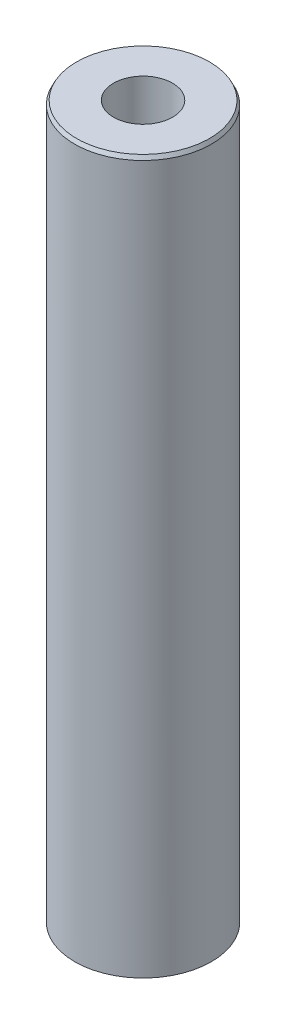
ISO-10303-21;
HEADER;
FILE_DESCRIPTION(('STEP AP214'),'2;1');
FILE_NAME('part.step','',(''),(''),'','','');
FILE_SCHEMA(('AUTOMOTIVE_DESIGN { 1 0 10303 214 1 1 1 1 }'));
ENDSEC;
DATA;
#1=APPLICATION_CONTEXT('core data for automotive mechanical design processes');
#2=APPLICATION_PROTOCOL_DEFINITION('international standard','automotive_design',2000,#1);
#3=PRODUCT_CONTEXT('',#1,'mechanical');
#4=PRODUCT('Part','Part','',(#3));
#5=PRODUCT_RELATED_PRODUCT_CATEGORY('part','',(#4));
#6=PRODUCT_DEFINITION_FORMATION('','',#4);
#7=PRODUCT_DEFINITION_CONTEXT('part definition',#1,'design');
#8=PRODUCT_DEFINITION('design','',#6,#7);
#9=PRODUCT_DEFINITION_SHAPE('','',#8);
#10=(LENGTH_UNIT() NAMED_UNIT(*) SI_UNIT(.MILLI.,.METRE.));
#11=(NAMED_UNIT(*) PLANE_ANGLE_UNIT() SI_UNIT($,.RADIAN.));
#12=(NAMED_UNIT(*) SI_UNIT($,.STERADIAN.) SOLID_ANGLE_UNIT());
#13=UNCERTAINTY_MEASURE_WITH_UNIT(LENGTH_MEASURE(1.E-05),#10,'distance_accuracy_value','');
#14=(GEOMETRIC_REPRESENTATION_CONTEXT(3) GLOBAL_UNCERTAINTY_ASSIGNED_CONTEXT((#13)) GLOBAL_UNIT_ASSIGNED_CONTEXT((#10,
#11,#12)) REPRESENTATION_CONTEXT('',''));
#15=CARTESIAN_POINT('',(0.,0.,0.));
#16=DIRECTION('',(0.,0.,1.));
#17=DIRECTION('',(1.,0.,0.));
#18=AXIS2_PLACEMENT_3D('',#15,#16,#17);
#19=CARTESIAN_POINT('',(0.,600.,0.));
#20=DIRECTION('',(0.,-1.,0.));
#21=DIRECTION('',(0.,0.,-1.));
#22=AXIS2_PLACEMENT_3D('',#19,#20,#21);
#23=CYLINDRICAL_SURFACE('',#22,57.5);
#24=CARTESIAN_POINT('',(0.,596.72802841033,0.));
#25=DIRECTION('',(0.,1.,0.));
#26=DIRECTION('',(0.,0.,1.));
#27=AXIS2_PLACEMENT_3D('',#24,#25,#26);
#28=CIRCLE('',#27,57.5);
#29=CARTESIAN_POINT('',(0.,596.72802841033,-57.5));
#30=VERTEX_POINT('',#29);
#31=EDGE_CURVE('E50',#30,#30,#28,.F.);
#32=ORIENTED_EDGE('',*,*,#31,.T.);
#33=EDGE_LOOP('',(#32));
#34=FACE_BOUND('',#33,.T.);
#35=CARTESIAN_POINT('',(0.,1.65994558215066,0.));
#36=DIRECTION('',(0.,1.,0.));
#37=DIRECTION('',(0.,0.,1.));
#38=AXIS2_PLACEMENT_3D('',#35,#36,#37);
#39=CIRCLE('',#38,57.5);
#40=CARTESIAN_POINT('',(0.,1.65994558215066,57.5));
#41=VERTEX_POINT('',#40);
#42=EDGE_CURVE('E51',#41,#41,#39,.T.);
#43=ORIENTED_EDGE('',*,*,#42,.T.);
#44=EDGE_LOOP('',(#43));
#45=FACE_BOUND('',#44,.T.);
#46=ADVANCED_FACE('F39',(#34,#45),#23,.T.);
#47=CARTESIAN_POINT('',(0.,600.,0.));
#48=DIRECTION('',(0.,1.,0.));
#49=DIRECTION('',(0.,0.,1.));
#50=AXIS2_PLACEMENT_3D('',#47,#48,#49);
#51=PLANE('',#50);
#52=CARTESIAN_POINT('',(0.,600.,0.));
#53=DIRECTION('',(0.,1.,0.));
#54=DIRECTION('',(0.,0.,1.));
#55=AXIS2_PLACEMENT_3D('',#52,#53,#54);
#56=CIRCLE('',#55,55.8400544178492);
#57=CARTESIAN_POINT('',(0.,600.,-55.8400544178493));
#58=VERTEX_POINT('',#57);
#59=EDGE_CURVE('E54',#58,#58,#56,.T.);
#60=ORIENTED_EDGE('',*,*,#59,.T.);
#61=EDGE_LOOP('',(#60));
#62=FACE_BOUND('',#61,.T.);
#63=CARTESIAN_POINT('',(0.,600.,0.));
#64=DIRECTION('',(0.,1.,0.));
#65=DIRECTION('',(0.,0.,1.));
#66=AXIS2_PLACEMENT_3D('',#63,#64,#65);
#67=CIRCLE('',#66,24.8235276278008);
#68=CARTESIAN_POINT('',(0.,600.,24.8235276278008));
#69=VERTEX_POINT('',#68);
#70=EDGE_CURVE('E58',#69,#69,#67,.T.);
#71=ORIENTED_EDGE('',*,*,#70,.F.);
#72=EDGE_LOOP('',(#71));
#73=FACE_BOUND('',#72,.T.);
#74=ADVANCED_FACE('F69',(#62,#73),#51,.T.);
#75=CARTESIAN_POINT('',(0.,0.,0.));
#76=DIRECTION('',(0.,1.,0.));
#77=DIRECTION('',(0.,0.,1.));
#78=AXIS2_PLACEMENT_3D('',#75,#76,#77);
#79=PLANE('',#78);
#80=CARTESIAN_POINT('',(0.,0.,0.));
#81=DIRECTION('',(0.,1.,0.));
#82=DIRECTION('',(0.,0.,1.));
#83=AXIS2_PLACEMENT_3D('',#80,#81,#82);
#84=CIRCLE('',#83,54.2280284103304);
#85=CARTESIAN_POINT('',(0.,0.,54.2280284103304));
#86=VERTEX_POINT('',#85);
#87=EDGE_CURVE('E10',#86,#86,#84,.F.);
#88=ORIENTED_EDGE('',*,*,#87,.T.);
#89=EDGE_LOOP('',(#88));
#90=FACE_BOUND('',#89,.T.);
#91=CARTESIAN_POINT('',(0.,0.,0.));
#92=DIRECTION('',(0.,1.,0.));
#93=DIRECTION('',(0.,0.,1.));
#94=AXIS2_PLACEMENT_3D('',#91,#92,#93);
#95=CIRCLE('',#94,24.8235276278008);
#96=CARTESIAN_POINT('',(0.,0.,24.8235276278008));
#97=VERTEX_POINT('',#96);
#98=EDGE_CURVE('E63',#97,#97,#95,.T.);
#99=ORIENTED_EDGE('',*,*,#98,.T.);
#100=EDGE_LOOP('',(#99));
#101=FACE_BOUND('',#100,.T.);
#102=ADVANCED_FACE('F75',(#90,#101),#79,.F.);
#103=CARTESIAN_POINT('',(0.,600.,0.));
#104=DIRECTION('',(0.,-1.,0.));
#105=DIRECTION('',(0.,0.,-1.));
#106=AXIS2_PLACEMENT_3D('',#103,#104,#105);
#107=CYLINDRICAL_SURFACE('',#106,24.8235276278008);
#108=ORIENTED_EDGE('',*,*,#70,.T.);
#109=EDGE_LOOP('',(#108));
#110=FACE_BOUND('',#109,.T.);
#111=ORIENTED_EDGE('',*,*,#98,.F.);
#112=EDGE_LOOP('',(#111));
#113=FACE_BOUND('',#112,.T.);
#114=ADVANCED_FACE('F70',(#110,#113),#107,.F.);
#115=CARTESIAN_POINT('',(0.,600.,0.));
#116=DIRECTION('',(0.,-1.,0.));
#117=DIRECTION('',(0.,0.,-1.));
#118=AXIS2_PLACEMENT_3D('',#115,#116,#117);
#119=CONICAL_SURFACE('',#118,55.8400544178492,0.469488623068551);
#120=CARTESIAN_POINT('',(0.,596.72802841033,-57.5));
#121=CARTESIAN_POINT('',(0.,596.762111447723,-57.482708900186));
#122=CARTESIAN_POINT('',(0.,596.796194485115,-57.4654178003719));
#123=CARTESIAN_POINT('',(0.,596.8643605599,-57.4308356007438));
#124=CARTESIAN_POINT('',(0.,596.898443597292,-57.4135445009297));
#125=CARTESIAN_POINT('',(0.,596.966609672077,-57.3789623013015));
#126=CARTESIAN_POINT('',(0.,597.000692709469,-57.3616712014875));
#127=CARTESIAN_POINT('',(0.,597.068858784254,-57.3270890018593));
#128=CARTESIAN_POINT('',(0.,597.102941821646,-57.3097979020452));
#129=CARTESIAN_POINT('',(0.,597.171107896431,-57.2752157024171));
#130=CARTESIAN_POINT('',(0.,597.205190933824,-57.257924602603));
#131=CARTESIAN_POINT('',(0.,597.273357008609,-57.2233424029749));
#132=CARTESIAN_POINT('',(0.,597.307440046001,-57.2060513031608));
#133=CARTESIAN_POINT('',(0.,597.375606120786,-57.1714691035327));
#134=CARTESIAN_POINT('',(0.,597.409689158178,-57.1541780037186));
#135=CARTESIAN_POINT('',(0.,597.477855232963,-57.1195958040905));
#136=CARTESIAN_POINT('',(0.,597.511938270355,-57.1023047042764));
#137=CARTESIAN_POINT('',(0.,597.58010434514,-57.0677225046483));
#138=CARTESIAN_POINT('',(0.,597.614187382532,-57.0504314048342));
#139=CARTESIAN_POINT('',(0.,597.682353457317,-57.015849205206));
#140=CARTESIAN_POINT('',(0.,597.71643649471,-56.998558105392));
#141=CARTESIAN_POINT('',(0.,597.784602569494,-56.9639759057639));
#142=CARTESIAN_POINT('',(0.,597.818685606887,-56.9466848059498));
#143=CARTESIAN_POINT('',(0.,597.886851681672,-56.9121026063216));
#144=CARTESIAN_POINT('',(0.,597.920934719064,-56.8948115065076));
#145=CARTESIAN_POINT('',(0.,597.989100793849,-56.8602293068794));
#146=CARTESIAN_POINT('',(0.,598.023183831241,-56.8429382070653));
#147=CARTESIAN_POINT('',(0.,598.091349906026,-56.8083560074372));
#148=CARTESIAN_POINT('',(0.,598.125432943418,-56.7910649076231));
#149=CARTESIAN_POINT('',(0.,598.193599018203,-56.756482707995));
#150=CARTESIAN_POINT('',(0.,598.227682055596,-56.7391916081809));
#151=CARTESIAN_POINT('',(0.,598.29584813038,-56.7046094085528));
#152=CARTESIAN_POINT('',(0.,598.329931167773,-56.6873183087387));
#153=CARTESIAN_POINT('',(0.,598.398097242557,-56.6527361091106));
#154=CARTESIAN_POINT('',(0.,598.43218027995,-56.6354450092965));
#155=CARTESIAN_POINT('',(0.,598.500346354735,-56.6008628096684));
#156=CARTESIAN_POINT('',(0.,598.534429392127,-56.5835717098543));
#157=CARTESIAN_POINT('',(0.,598.602595466912,-56.5489895102261));
#158=CARTESIAN_POINT('',(0.,598.636678504304,-56.5316984104121));
#159=CARTESIAN_POINT('',(0.,598.704844579089,-56.4971162107839));
#160=CARTESIAN_POINT('',(0.,598.738927616481,-56.4798251109699));
#161=CARTESIAN_POINT('',(0.,598.807093691266,-56.4452429113417));
#162=CARTESIAN_POINT('',(0.,598.841176728659,-56.4279518115277));
#163=CARTESIAN_POINT('',(0.,598.909342803443,-56.3933696118995));
#164=CARTESIAN_POINT('',(0.,598.943425840836,-56.3760785120854));
#165=CARTESIAN_POINT('',(0.,599.01159191562,-56.3414963124573));
#166=CARTESIAN_POINT('',(0.,599.045674953013,-56.3242052126432));
#167=CARTESIAN_POINT('',(0.,599.113841027798,-56.2896230130151));
#168=CARTESIAN_POINT('',(0.,599.14792406519,-56.272331913201));
#169=CARTESIAN_POINT('',(0.,599.216090139975,-56.2377497135729));
#170=CARTESIAN_POINT('',(0.,599.250173177367,-56.2204586137588));
#171=CARTESIAN_POINT('',(0.,599.318339252152,-56.1858764141307));
#172=CARTESIAN_POINT('',(0.,599.352422289544,-56.1685853143166));
#173=CARTESIAN_POINT('',(0.,599.420588364329,-56.1340031146884));
#174=CARTESIAN_POINT('',(0.,599.454671401722,-56.1167120148744));
#175=CARTESIAN_POINT('',(0.,599.522837476506,-56.0821298152462));
#176=CARTESIAN_POINT('',(0.,599.556920513899,-56.0648387154322));
#177=CARTESIAN_POINT('',(0.,599.625086588684,-56.030256515804));
#178=CARTESIAN_POINT('',(0.,599.659169626076,-56.01296541599));
#179=CARTESIAN_POINT('',(0.,599.727335700861,-55.9783832163618));
#180=CARTESIAN_POINT('',(0.,599.761418738253,-55.9610921165477));
#181=CARTESIAN_POINT('',(0.,599.829584813038,-55.9265099169196));
#182=CARTESIAN_POINT('',(0.,599.86366785043,-55.9092188171055));
#183=CARTESIAN_POINT('',(0.,599.931833925215,-55.8746366174774));
#184=CARTESIAN_POINT('',(0.,599.965916962608,-55.8573455176633));
#185=CARTESIAN_POINT('',(0.,600.,-55.8400544178493));
#186=B_SPLINE_CURVE_WITH_KNOTS('',3,(#120,#121,#122,#123,#124,#125,#126,#127,#128,#129,#130,
#131,#132,#133,#134,#135,#136,#137,#138,#139,#140,#141,#142,#143,#144,#145,#146,#147,#148,#149,
#150,#151,#152,#153,#154,#155,#156,#157,#158,#159,#160,#161,#162,#163,#164,#165,#166,#167,#168,
#169,#170,#171,#172,#173,#174,#175,#176,#177,#178,#179,#180,#181,#182,#183,#184,#185),
.UNSPECIFIED.,.F.,.F.,(4,2,2,2,2,2,2,2,2,2,2,2,2,2,2,2,2,2,2,2,2,2,2,2,2,2,2,2,2,2,2,2,4),(0.,
0.114654786799593,0.22930957359909,0.343964360398584,0.458619147198082,0.573273933997678,
0.687928720797172,0.802583507596669,0.917238294396163,1.03189308119566,1.14654786799525,
1.26120265479475,1.37585744159424,1.49051222839374,1.60516701519333,1.71982180199283,
1.83447658879233,1.94913137559182,2.06378616239132,2.17844094919091,2.29309573599041,
2.4077505227899,2.5224053095894,2.63706009638899,2.75171488318849,2.86636966998799,
2.98102445678748,3.09567924358698,3.21033403038657,3.32498881718607,3.43964360398556,
3.55429839078506,3.66895317758465),.UNSPECIFIED.);
#187=EDGE_CURVE('BSEAM81',#30,#58,#186,.T.);
#188=ORIENTED_EDGE('',*,*,#31,.F.);
#189=ORIENTED_EDGE('',*,*,#59,.F.);
#190=ORIENTED_EDGE('',*,*,#187,.T.);
#191=ORIENTED_EDGE('',*,*,#187,.F.);
#192=EDGE_LOOP('',(#188,#190,#189,#191));
#193=FACE_BOUND('',#192,.T.);
#194=ADVANCED_FACE('F81',(#193),#119,.T.);
#195=CARTESIAN_POINT('',(0.,1.65994558215066,0.));
#196=DIRECTION('',(0.,1.,0.));
#197=DIRECTION('',(0.,0.,1.));
#198=AXIS2_PLACEMENT_3D('',#195,#196,#197);
#199=CONICAL_SURFACE('',#198,57.5,1.10130770372636);
#200=ORIENTED_EDGE('',*,*,#87,.F.);
#201=EDGE_LOOP('',(#200));
#202=FACE_BOUND('',#201,.T.);
#203=ORIENTED_EDGE('',*,*,#42,.F.);
#204=EDGE_LOOP('',(#203));
#205=FACE_BOUND('',#204,.T.);
#206=ADVANCED_FACE('F45',(#202,#205),#199,.T.);
#207=CLOSED_SHELL('',(#46,#74,#102,#114,#194,#206));
#208=MANIFOLD_SOLID_BREP('B2',#207);
#209=ADVANCED_BREP_SHAPE_REPRESENTATION('',(#18,#208),#14);
#210=SHAPE_DEFINITION_REPRESENTATION(#9,#209);
ENDSEC;
END-ISO-10303-21;
